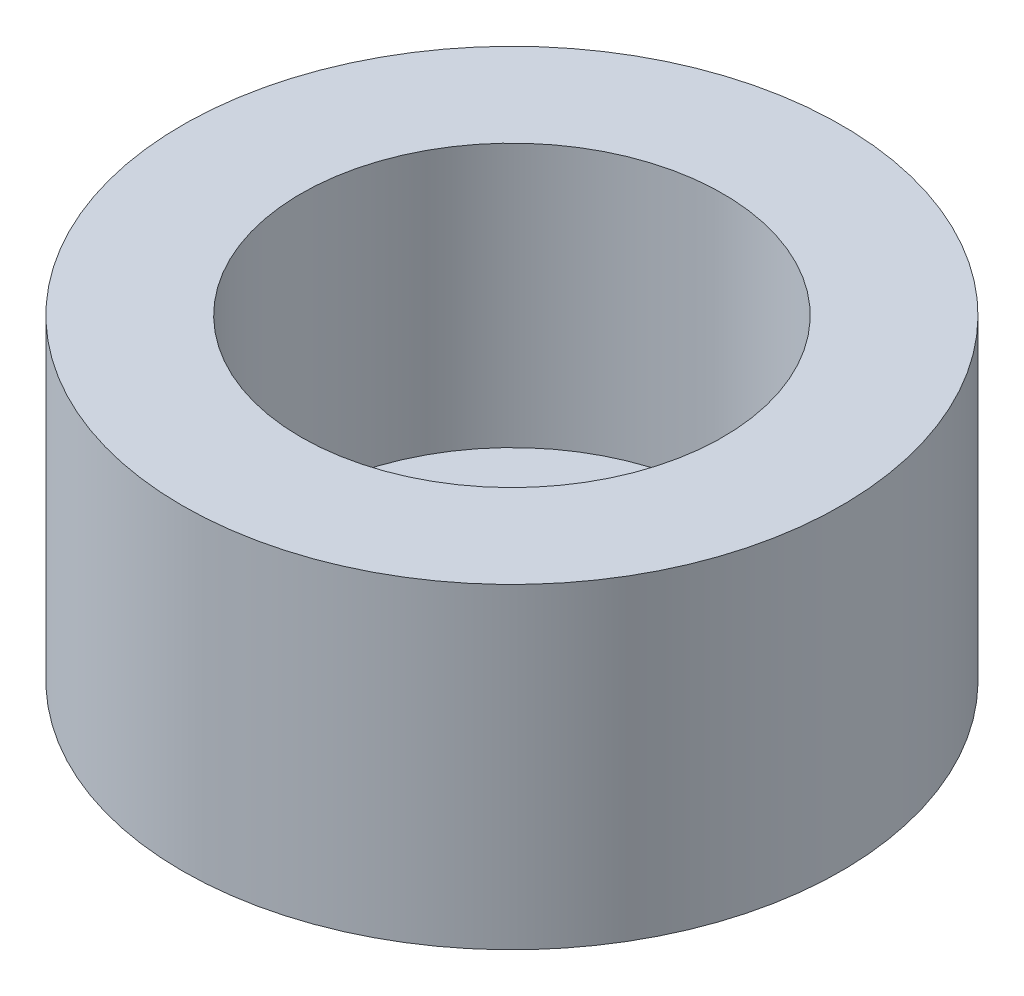
ISO-10303-21;
HEADER;
FILE_DESCRIPTION(('STEP AP214'),'2;1');
FILE_NAME('part.step','',(''),(''),'','','');
FILE_SCHEMA(('AUTOMOTIVE_DESIGN { 1 0 10303 214 1 1 1 1 }'));
ENDSEC;
DATA;
#1=APPLICATION_CONTEXT('core data for automotive mechanical design processes');
#2=APPLICATION_PROTOCOL_DEFINITION('international standard','automotive_design',2000,#1);
#3=PRODUCT_CONTEXT('',#1,'mechanical');
#4=PRODUCT('Part','Part','',(#3));
#5=PRODUCT_RELATED_PRODUCT_CATEGORY('part','',(#4));
#6=PRODUCT_DEFINITION_FORMATION('','',#4);
#7=PRODUCT_DEFINITION_CONTEXT('part definition',#1,'design');
#8=PRODUCT_DEFINITION('design','',#6,#7);
#9=PRODUCT_DEFINITION_SHAPE('','',#8);
#10=(LENGTH_UNIT() NAMED_UNIT(*) SI_UNIT(.MILLI.,.METRE.));
#11=(NAMED_UNIT(*) PLANE_ANGLE_UNIT() SI_UNIT($,.RADIAN.));
#12=(NAMED_UNIT(*) SI_UNIT($,.STERADIAN.) SOLID_ANGLE_UNIT());
#13=UNCERTAINTY_MEASURE_WITH_UNIT(LENGTH_MEASURE(1.E-05),#10,'distance_accuracy_value','');
#14=(GEOMETRIC_REPRESENTATION_CONTEXT(3) GLOBAL_UNCERTAINTY_ASSIGNED_CONTEXT((#13)) GLOBAL_UNIT_ASSIGNED_CONTEXT((#10,
#11,#12)) REPRESENTATION_CONTEXT('',''));
#15=CARTESIAN_POINT('',(0.,0.,0.));
#16=DIRECTION('',(0.,0.,1.));
#17=DIRECTION('',(1.,0.,0.));
#18=AXIS2_PLACEMENT_3D('',#15,#16,#17);
#19=CARTESIAN_POINT('',(0.,2.,0.));
#20=DIRECTION('',(0.,-1.,0.));
#21=DIRECTION('',(0.,0.,-1.));
#22=AXIS2_PLACEMENT_3D('',#19,#20,#21);
#23=CYLINDRICAL_SURFACE('',#22,12.5);
#24=CARTESIAN_POINT('',(0.,0.,0.));
#25=DIRECTION('',(0.,1.,0.));
#26=DIRECTION('',(0.,0.,1.));
#27=AXIS2_PLACEMENT_3D('',#24,#25,#26);
#28=CIRCLE('',#27,12.5);
#29=CARTESIAN_POINT('',(0.,0.,12.5));
#30=VERTEX_POINT('',#29);
#31=EDGE_CURVE('E51',#30,#30,#28,.T.);
#32=ORIENTED_EDGE('',*,*,#31,.T.);
#33=EDGE_LOOP('',(#32));
#34=FACE_BOUND('',#33,.T.);
#35=CARTESIAN_POINT('',(0.,12.,0.));
#36=DIRECTION('',(0.,1.,0.));
#37=DIRECTION('',(0.,0.,1.));
#38=AXIS2_PLACEMENT_3D('',#35,#36,#37);
#39=CIRCLE('',#38,12.5);
#40=CARTESIAN_POINT('',(0.,12.,12.5));
#41=VERTEX_POINT('',#40);
#42=EDGE_CURVE('E56',#41,#41,#39,.T.);
#43=ORIENTED_EDGE('',*,*,#42,.F.);
#44=EDGE_LOOP('',(#43));
#45=FACE_BOUND('',#44,.T.);
#46=ADVANCED_FACE('F43',(#34,#45),#23,.T.);
#47=CARTESIAN_POINT('',(0.,0.,0.));
#48=DIRECTION('',(0.,1.,0.));
#49=DIRECTION('',(0.,0.,1.));
#50=AXIS2_PLACEMENT_3D('',#47,#48,#49);
#51=PLANE('',#50);
#52=CARTESIAN_POINT('',(0.,0.,0.));
#53=DIRECTION('',(0.,1.,0.));
#54=DIRECTION('',(0.,0.,1.));
#55=AXIS2_PLACEMENT_3D('',#52,#53,#54);
#56=CIRCLE('',#55,2.1);
#57=CARTESIAN_POINT('',(0.,0.,2.1));
#58=VERTEX_POINT('',#57);
#59=EDGE_CURVE('E46',#58,#58,#56,.T.);
#60=ORIENTED_EDGE('',*,*,#59,.T.);
#61=EDGE_LOOP('',(#60));
#62=FACE_BOUND('',#61,.T.);
#63=ORIENTED_EDGE('',*,*,#31,.F.);
#64=EDGE_LOOP('',(#63));
#65=FACE_BOUND('',#64,.T.);
#66=ADVANCED_FACE('F75',(#62,#65),#51,.F.);
#67=CARTESIAN_POINT('',(0.,12.,0.));
#68=DIRECTION('',(0.,1.,0.));
#69=DIRECTION('',(0.,0.,1.));
#70=AXIS2_PLACEMENT_3D('',#67,#68,#69);
#71=PLANE('',#70);
#72=ORIENTED_EDGE('',*,*,#42,.T.);
#73=EDGE_LOOP('',(#72));
#74=FACE_BOUND('',#73,.T.);
#75=CARTESIAN_POINT('',(0.,12.,0.));
#76=DIRECTION('',(0.,1.,0.));
#77=DIRECTION('',(0.,0.,1.));
#78=AXIS2_PLACEMENT_3D('',#75,#76,#77);
#79=CIRCLE('',#78,8.);
#80=CARTESIAN_POINT('',(0.,12.,8.));
#81=VERTEX_POINT('',#80);
#82=EDGE_CURVE('E62',#81,#81,#79,.T.);
#83=ORIENTED_EDGE('',*,*,#82,.F.);
#84=EDGE_LOOP('',(#83));
#85=FACE_BOUND('',#84,.T.);
#86=ADVANCED_FACE('F95',(#74,#85),#71,.T.);
#87=CARTESIAN_POINT('',(0.,12.,0.));
#88=DIRECTION('',(0.,-1.,0.));
#89=DIRECTION('',(0.,0.,-1.));
#90=AXIS2_PLACEMENT_3D('',#87,#88,#89);
#91=CYLINDRICAL_SURFACE('',#90,8.);
#92=ORIENTED_EDGE('',*,*,#82,.T.);
#93=EDGE_LOOP('',(#92));
#94=FACE_BOUND('',#93,.T.);
#95=CARTESIAN_POINT('',(0.,2.,0.));
#96=DIRECTION('',(0.,1.,0.));
#97=DIRECTION('',(0.,0.,1.));
#98=AXIS2_PLACEMENT_3D('',#95,#96,#97);
#99=CIRCLE('',#98,8.);
#100=CARTESIAN_POINT('',(0.,2.,8.));
#101=VERTEX_POINT('',#100);
#102=EDGE_CURVE('E10',#101,#101,#99,.F.);
#103=ORIENTED_EDGE('',*,*,#102,.T.);
#104=EDGE_LOOP('',(#103));
#105=FACE_BOUND('',#104,.T.);
#106=ADVANCED_FACE('F85',(#94,#105),#91,.F.);
#107=CARTESIAN_POINT('',(0.,2.,0.));
#108=DIRECTION('',(0.,1.,0.));
#109=DIRECTION('',(0.,0.,1.));
#110=AXIS2_PLACEMENT_3D('',#107,#108,#109);
#111=PLANE('',#110);
#112=CARTESIAN_POINT('',(0.,2.,0.));
#113=DIRECTION('',(0.,1.,0.));
#114=DIRECTION('',(0.,0.,1.));
#115=AXIS2_PLACEMENT_3D('',#112,#113,#114);
#116=CIRCLE('',#115,2.1);
#117=CARTESIAN_POINT('',(0.,2.,2.1));
#118=VERTEX_POINT('',#117);
#119=EDGE_CURVE('E66',#118,#118,#116,.T.);
#120=ORIENTED_EDGE('',*,*,#119,.F.);
#121=EDGE_LOOP('',(#120));
#122=FACE_BOUND('',#121,.T.);
#123=ORIENTED_EDGE('',*,*,#102,.F.);
#124=EDGE_LOOP('',(#123));
#125=FACE_BOUND('',#124,.T.);
#126=ADVANCED_FACE('F80',(#122,#125),#111,.T.);
#127=CARTESIAN_POINT('',(0.,-8.,0.));
#128=DIRECTION('',(0.,1.,0.));
#129=DIRECTION('',(0.,0.,1.));
#130=AXIS2_PLACEMENT_3D('',#127,#128,#129);
#131=CYLINDRICAL_SURFACE('',#130,2.1);
#132=ORIENTED_EDGE('',*,*,#119,.T.);
#133=EDGE_LOOP('',(#132));
#134=FACE_BOUND('',#133,.T.);
#135=ORIENTED_EDGE('',*,*,#59,.F.);
#136=EDGE_LOOP('',(#135));
#137=FACE_BOUND('',#136,.T.);
#138=ADVANCED_FACE('F78',(#134,#137),#131,.F.);
#139=CLOSED_SHELL('',(#46,#66,#86,#106,#126,#138));
#140=MANIFOLD_SOLID_BREP('B2',#139);
#141=ADVANCED_BREP_SHAPE_REPRESENTATION('',(#18,#140),#14);
#142=SHAPE_DEFINITION_REPRESENTATION(#9,#141);
ENDSEC;
END-ISO-10303-21;
